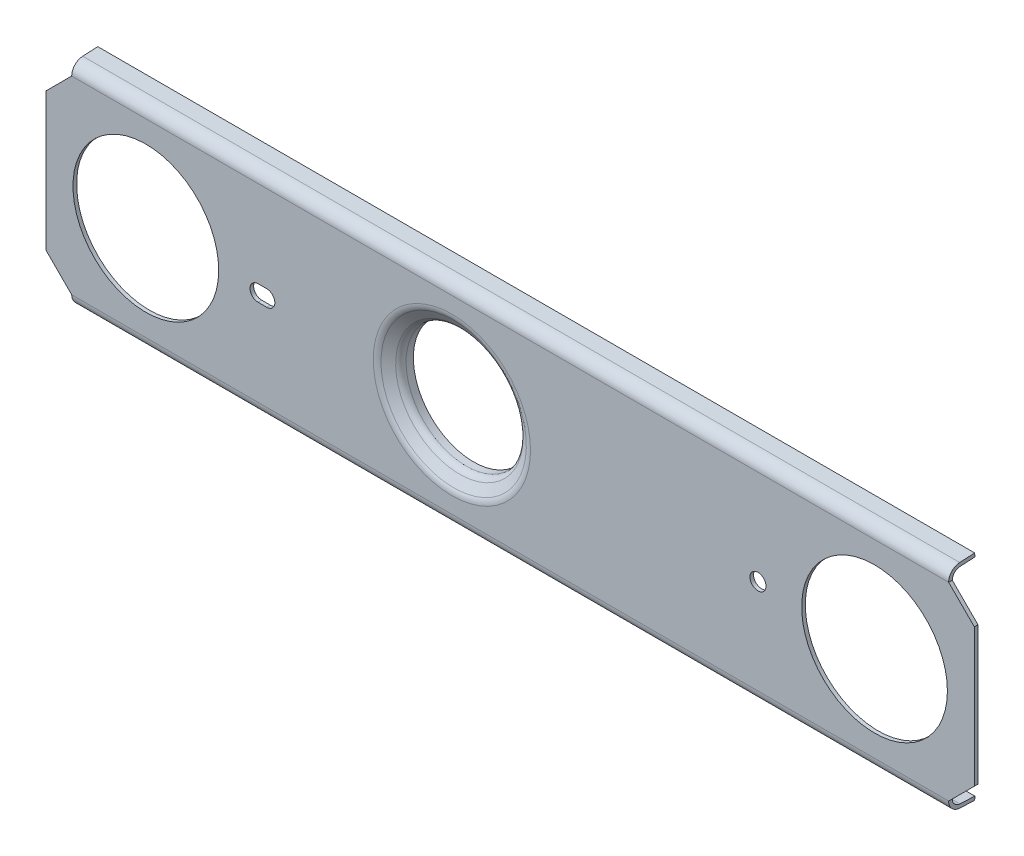
ISO-10303-21;
HEADER;
FILE_DESCRIPTION(('STEP AP214'),'2;1');
FILE_NAME('part.step','',(''),(''),'','','');
FILE_SCHEMA(('AUTOMOTIVE_DESIGN { 1 0 10303 214 1 1 1 1 }'));
ENDSEC;
DATA;
#1=APPLICATION_CONTEXT('core data for automotive mechanical design processes');
#2=APPLICATION_PROTOCOL_DEFINITION('international standard','automotive_design',2000,#1);
#3=PRODUCT_CONTEXT('',#1,'mechanical');
#4=PRODUCT('Part','Part','',(#3));
#5=PRODUCT_RELATED_PRODUCT_CATEGORY('part','',(#4));
#6=PRODUCT_DEFINITION_FORMATION('','',#4);
#7=PRODUCT_DEFINITION_CONTEXT('part definition',#1,'design');
#8=PRODUCT_DEFINITION('design','',#6,#7);
#9=PRODUCT_DEFINITION_SHAPE('','',#8);
#10=(LENGTH_UNIT() NAMED_UNIT(*) SI_UNIT(.MILLI.,.METRE.));
#11=(NAMED_UNIT(*) PLANE_ANGLE_UNIT() SI_UNIT($,.RADIAN.));
#12=(NAMED_UNIT(*) SI_UNIT($,.STERADIAN.) SOLID_ANGLE_UNIT());
#13=UNCERTAINTY_MEASURE_WITH_UNIT(LENGTH_MEASURE(1.E-05),#10,'distance_accuracy_value','');
#14=(GEOMETRIC_REPRESENTATION_CONTEXT(3) GLOBAL_UNCERTAINTY_ASSIGNED_CONTEXT((#13)) GLOBAL_UNIT_ASSIGNED_CONTEXT((#10,
#11,#12)) REPRESENTATION_CONTEXT('',''));
#15=CARTESIAN_POINT('',(0.,0.,0.));
#16=DIRECTION('',(0.,0.,1.));
#17=DIRECTION('',(1.,0.,0.));
#18=AXIS2_PLACEMENT_3D('',#15,#16,#17);
#19=CARTESIAN_POINT('',(-11.5,0.,-4.273055848962));
#20=DIRECTION('',(0.,0.,1.));
#21=DIRECTION('',(1.,0.,0.));
#22=AXIS2_PLACEMENT_3D('',#19,#20,#21);
#23=CYLINDRICAL_SURFACE('',#22,4.375);
#24=CARTESIAN_POINT('',(-11.5,0.,-4.199100808535));
#25=DIRECTION('',(0.,0.,1.));
#26=DIRECTION('',(1.,0.,0.));
#27=AXIS2_PLACEMENT_3D('',#24,#25,#26);
#28=CIRCLE('',#27,4.375);
#29=CARTESIAN_POINT('',(-7.125,0.,-4.199100808535));
#30=VERTEX_POINT('',#29);
#31=EDGE_CURVE('E206',#30,#30,#28,.T.);
#32=ORIENTED_EDGE('',*,*,#31,.T.);
#33=EDGE_LOOP('',(#32));
#34=FACE_BOUND('',#33,.T.);
#35=CARTESIAN_POINT('',(-11.5,0.,-3.699100808535));
#36=DIRECTION('',(0.,0.,1.));
#37=DIRECTION('',(0.,1.,0.));
#38=AXIS2_PLACEMENT_3D('',#35,#36,#37);
#39=CIRCLE('',#38,4.375);
#40=CARTESIAN_POINT('',(-11.5,4.375,-3.699100808535));
#41=VERTEX_POINT('',#40);
#42=EDGE_CURVE('E205',#41,#41,#39,.F.);
#43=ORIENTED_EDGE('',*,*,#42,.T.);
#44=EDGE_LOOP('',(#43));
#45=FACE_BOUND('',#44,.T.);
#46=ADVANCED_FACE('F17',(#34,#45),#23,.T.);
#47=CARTESIAN_POINT('',(-11.5,0.,-4.199100808535));
#48=DIRECTION('',(0.,0.,1.));
#49=DIRECTION('',(1.,0.,0.));
#50=AXIS2_PLACEMENT_3D('',#47,#48,#49);
#51=PLANE('',#50);
#52=CARTESIAN_POINT('',(-11.5,0.,-4.199100808535));
#53=DIRECTION('',(0.,0.,1.));
#54=DIRECTION('',(1.,0.,0.));
#55=AXIS2_PLACEMENT_3D('',#52,#53,#54);
#56=CIRCLE('',#55,4.125);
#57=CARTESIAN_POINT('',(-7.375,0.,-4.199100808535));
#58=VERTEX_POINT('',#57);
#59=EDGE_CURVE('E201',#58,#58,#56,.T.);
#60=ORIENTED_EDGE('',*,*,#59,.T.);
#61=EDGE_LOOP('',(#60));
#62=FACE_BOUND('',#61,.T.);
#63=ORIENTED_EDGE('',*,*,#31,.F.);
#64=EDGE_LOOP('',(#63));
#65=FACE_BOUND('',#64,.T.);
#66=ADVANCED_FACE('F485',(#62,#65),#51,.F.);
#67=CARTESIAN_POINT('',(-11.5,0.,-3.699100808535));
#68=DIRECTION('',(0.,0.,1.));
#69=DIRECTION('',(0.,1.,0.));
#70=AXIS2_PLACEMENT_3D('',#67,#68,#69);
#71=TOROIDAL_SURFACE('',#70,4.675,0.3);
#72=ORIENTED_EDGE('',*,*,#42,.F.);
#73=EDGE_LOOP('',(#72));
#74=FACE_BOUND('',#73,.T.);
#75=CARTESIAN_POINT('',(-11.5,0.,-3.44749963807089));
#76=DIRECTION('',(0.,0.,1.));
#77=DIRECTION('',(0.,1.,0.));
#78=AXIS2_PLACEMENT_3D('',#75,#76,#77);
#79=CIRCLE('',#78,4.5116082894765);
#80=CARTESIAN_POINT('',(-11.5,4.5116082894765,-3.44749963807089));
#81=VERTEX_POINT('',#80);
#82=EDGE_CURVE('E175',#81,#81,#79,.T.);
#83=ORIENTED_EDGE('',*,*,#82,.F.);
#84=EDGE_LOOP('',(#83));
#85=FACE_BOUND('',#84,.T.);
#86=ADVANCED_FACE('F481',(#74,#85),#71,.F.);
#87=CARTESIAN_POINT('',(-11.5,0.,-4.273055848962));
#88=DIRECTION('',(0.,0.,1.));
#89=DIRECTION('',(1.,0.,0.));
#90=AXIS2_PLACEMENT_3D('',#87,#88,#89);
#91=CYLINDRICAL_SURFACE('',#90,4.125);
#92=ORIENTED_EDGE('',*,*,#59,.F.);
#93=EDGE_LOOP('',(#92));
#94=FACE_BOUND('',#93,.T.);
#95=CARTESIAN_POINT('',(-11.5,0.,-3.699100808535));
#96=DIRECTION('',(0.,0.,1.));
#97=DIRECTION('',(0.,1.,0.));
#98=AXIS2_PLACEMENT_3D('',#95,#96,#97);
#99=CIRCLE('',#98,4.125);
#100=CARTESIAN_POINT('',(-11.5,4.125,-3.699100808535));
#101=VERTEX_POINT('',#100);
#102=EDGE_CURVE('E559',#101,#101,#99,.F.);
#103=ORIENTED_EDGE('',*,*,#102,.F.);
#104=EDGE_LOOP('',(#103));
#105=FACE_BOUND('',#104,.T.);
#106=ADVANCED_FACE('F477',(#94,#105),#91,.F.);
#107=CARTESIAN_POINT('',(22.58478643763,7.049246244115,-3.491215224066));
#108=DIRECTION('',(0.,-0.998629534754574,-0.0523359562429386));
#109=DIRECTION('',(0.,0.0523359562429386,-0.998629534754574));
#110=AXIS2_PLACEMENT_3D('',#107,#108,#109);
#111=PLANE('',#110);
#112=DIRECTION('',(1.,0.,0.));
#113=VECTOR('',#112,1.);
#114=CARTESIAN_POINT('',(22.58478643763,7.103162569582,-4.52));
#115=LINE('',#114,#113);
#116=CARTESIAN_POINT('',(22.58478643763,7.10316256958197,-4.52));
#117=VERTEX_POINT('',#116);
#118=CARTESIAN_POINT('',(-37.58678643763,7.10316256958197,-4.52));
#119=VERTEX_POINT('',#118);
#120=EDGE_CURVE('E564',#117,#119,#115,.F.);
#121=ORIENTED_EDGE('',*,*,#120,.F.);
#122=DIRECTION('',(0.,0.0523359562429386,-0.998629534754574));
#123=VECTOR('',#122,1.);
#124=CARTESIAN_POINT('',(22.58478643763,7.049246244115,-3.491215224066));
#125=LINE('',#124,#123);
#126=CARTESIAN_POINT('',(22.58478643763,7.04924624411501,-3.49121522406619));
#127=VERTEX_POINT('',#126);
#128=EDGE_CURVE('E582',#117,#127,#125,.F.);
#129=ORIENTED_EDGE('',*,*,#128,.T.);
#130=DIRECTION('',(1.,0.,0.));
#131=VECTOR('',#130,1.);
#132=CARTESIAN_POINT('',(22.58478643763,7.049246244115,-3.491215224066));
#133=LINE('',#132,#131);
#134=CARTESIAN_POINT('',(-37.58678643763,7.04924624411501,-3.49121522406619));
#135=VERTEX_POINT('',#134);
#136=EDGE_CURVE('E184',#127,#135,#133,.F.);
#137=ORIENTED_EDGE('',*,*,#136,.T.);
#138=DIRECTION('',(0.,0.0523359562429386,-0.998629534754574));
#139=VECTOR('',#138,1.);
#140=CARTESIAN_POINT('',(-37.58678643763,7.049246244115,-3.491215224066));
#141=LINE('',#140,#139);
#142=EDGE_CURVE('E204',#135,#119,#141,.T.);
#143=ORIENTED_EDGE('',*,*,#142,.T.);
#144=EDGE_LOOP('',(#121,#129,#137,#143));
#145=FACE_BOUND('',#144,.T.);
#146=ADVANCED_FACE('F474',(#145),#111,.T.);
#147=CARTESIAN_POINT('',(22.58478643763,-7.103162569582,-4.52));
#148=DIRECTION('',(0.,0.998629534754574,-0.0523359562429386));
#149=DIRECTION('',(0.,0.0523359562429386,0.998629534754574));
#150=AXIS2_PLACEMENT_3D('',#147,#148,#149);
#151=PLANE('',#150);
#152=DIRECTION('',(1.,0.,0.));
#153=VECTOR('',#152,1.);
#154=CARTESIAN_POINT('',(22.58478643763,-7.049246244115,-3.491215224066));
#155=LINE('',#154,#153);
#156=CARTESIAN_POINT('',(-37.58678643763,-7.04924624411506,-3.49121522406619));
#157=VERTEX_POINT('',#156);
#158=CARTESIAN_POINT('',(22.58478643763,-7.04924624411506,-3.49121522406619));
#159=VERTEX_POINT('',#158);
#160=EDGE_CURVE('E179',#157,#159,#155,.T.);
#161=ORIENTED_EDGE('',*,*,#160,.T.);
#162=DIRECTION('',(0.,0.0523359562429386,0.998629534754574));
#163=VECTOR('',#162,1.);
#164=CARTESIAN_POINT('',(22.58478643763,-7.103162569582,-4.52));
#165=LINE('',#164,#163);
#166=CARTESIAN_POINT('',(22.58478643763,-7.10316256958199,-4.51999999999984));
#167=VERTEX_POINT('',#166);
#168=EDGE_CURVE('E164',#159,#167,#165,.F.);
#169=ORIENTED_EDGE('',*,*,#168,.T.);
#170=DIRECTION('',(1.,0.,0.));
#171=VECTOR('',#170,1.);
#172=CARTESIAN_POINT('',(22.58478643763,-7.10316256958199,-4.51999999999976));
#173=LINE('',#172,#171);
#174=CARTESIAN_POINT('',(-37.58678643763,-7.10316256958199,-4.51999999999984));
#175=VERTEX_POINT('',#174);
#176=EDGE_CURVE('E573',#175,#167,#173,.T.);
#177=ORIENTED_EDGE('',*,*,#176,.F.);
#178=DIRECTION('',(0.,0.0523359562429386,0.998629534754574));
#179=VECTOR('',#178,1.);
#180=CARTESIAN_POINT('',(-37.58678643763,-7.103162569582,-4.52));
#181=LINE('',#180,#179);
#182=EDGE_CURVE('E176',#175,#157,#181,.T.);
#183=ORIENTED_EDGE('',*,*,#182,.T.);
#184=EDGE_LOOP('',(#161,#169,#177,#183));
#185=FACE_BOUND('',#184,.T.);
#186=ADVANCED_FACE('F180',(#185),#151,.T.);
#187=CARTESIAN_POINT('',(-11.5,0.,-3.05066471611326));
#188=DIRECTION('',(0.,0.,1.));
#189=DIRECTION('',(1.,0.,0.));
#190=AXIS2_PLACEMENT_3D('',#187,#188,#189);
#191=CONICAL_SURFACE('',#190,5.1226804823159,0.994837673622212);
#192=ORIENTED_EDGE('',*,*,#82,.T.);
#193=EDGE_LOOP('',(#192));
#194=FACE_BOUND('',#193,.T.);
#195=CARTESIAN_POINT('',(-11.5,0.,-3.05066471602742));
#196=DIRECTION('',(0.,0.,1.));
#197=DIRECTION('',(0.,1.,0.));
#198=AXIS2_PLACEMENT_3D('',#195,#196,#197);
#199=CIRCLE('',#198,5.12268048249228);
#200=CARTESIAN_POINT('',(-11.5,5.12268048249228,-3.05066471602742));
#201=VERTEX_POINT('',#200);
#202=EDGE_CURVE('E183',#201,#201,#199,.F.);
#203=ORIENTED_EDGE('',*,*,#202,.T.);
#204=EDGE_LOOP('',(#203));
#205=FACE_BOUND('',#204,.T.);
#206=ADVANCED_FACE('F467',(#194,#205),#191,.T.);
#207=CARTESIAN_POINT('',(22.58478643763,-7.352819953271,-4.506916010939));
#208=DIRECTION('',(0.,-0.0523359562429486,-0.998629534754574));
#209=DIRECTION('',(0.,0.998629534754574,-0.0523359562429486));
#210=AXIS2_PLACEMENT_3D('',#207,#208,#209);
#211=PLANE('',#210);
#212=ORIENTED_EDGE('',*,*,#176,.T.);
#213=DIRECTION('',(0.,0.998629534754574,-0.0523359562429486));
#214=VECTOR('',#213,1.);
#215=CARTESIAN_POINT('',(22.58478643763,-7.352819953271,-4.506916010939));
#216=LINE('',#215,#214);
#217=CARTESIAN_POINT('',(22.58478643763,-7.35281995327095,-4.506916010939));
#218=VERTEX_POINT('',#217);
#219=EDGE_CURVE('E171',#167,#218,#216,.F.);
#220=ORIENTED_EDGE('',*,*,#219,.T.);
#221=DIRECTION('',(1.,0.,0.));
#222=VECTOR('',#221,1.);
#223=CARTESIAN_POINT('',(22.58478643763,-7.35281995327084,-4.50691601093901));
#224=LINE('',#223,#222);
#225=CARTESIAN_POINT('',(-37.58678643763,-7.35281995327095,-4.506916010939));
#226=VERTEX_POINT('',#225);
#227=EDGE_CURVE('E197',#226,#218,#224,.T.);
#228=ORIENTED_EDGE('',*,*,#227,.F.);
#229=DIRECTION('',(0.,0.998629534754574,-0.0523359562429486));
#230=VECTOR('',#229,1.);
#231=CARTESIAN_POINT('',(-37.58678643763,-7.352819953271,-4.506916010939));
#232=LINE('',#231,#230);
#233=EDGE_CURVE('E570',#226,#175,#232,.T.);
#234=ORIENTED_EDGE('',*,*,#233,.T.);
#235=EDGE_LOOP('',(#212,#220,#228,#234));
#236=FACE_BOUND('',#235,.T.);
#237=ADVANCED_FACE('F463',(#236),#211,.T.);
#238=CARTESIAN_POINT('',(22.58478643763,7.103162569582,-4.52));
#239=DIRECTION('',(0.,0.0523359562429386,-0.998629534754574));
#240=DIRECTION('',(0.,0.998629534754574,0.0523359562429386));
#241=AXIS2_PLACEMENT_3D('',#238,#239,#240);
#242=PLANE('',#241);
#243=DIRECTION('',(1.,0.,0.));
#244=VECTOR('',#243,1.);
#245=CARTESIAN_POINT('',(22.58478643763,7.352819953271,-4.506916010939));
#246=LINE('',#245,#244);
#247=CARTESIAN_POINT('',(22.58478643763,7.352819953271,-4.506916010939));
#248=VERTEX_POINT('',#247);
#249=CARTESIAN_POINT('',(-37.58678643763,7.352819953271,-4.50691601093908));
#250=VERTEX_POINT('',#249);
#251=EDGE_CURVE('E378',#248,#250,#246,.F.);
#252=ORIENTED_EDGE('',*,*,#251,.F.);
#253=DIRECTION('',(0.,0.998629534754523,0.0523359562439203));
#254=VECTOR('',#253,1.);
#255=CARTESIAN_POINT('',(22.58478643763,7.103162569582,-4.52));
#256=LINE('',#255,#254);
#257=EDGE_CURVE('E195',#117,#248,#256,.T.);
#258=ORIENTED_EDGE('',*,*,#257,.F.);
#259=ORIENTED_EDGE('',*,*,#120,.T.);
#260=DIRECTION('',(0.,0.998629534754574,0.0523359562429386));
#261=VECTOR('',#260,1.);
#262=CARTESIAN_POINT('',(-37.58678643763,7.103162569582,-4.52));
#263=LINE('',#262,#261);
#264=EDGE_CURVE('E545',#119,#250,#263,.T.);
#265=ORIENTED_EDGE('',*,*,#264,.T.);
#266=EDGE_LOOP('',(#252,#258,#259,#265));
#267=FACE_BOUND('',#266,.T.);
#268=ADVANCED_FACE('F459',(#267),#242,.T.);
#269=CARTESIAN_POINT('',(-11.5,0.,-3.699100808535));
#270=DIRECTION('',(0.,0.,1.));
#271=DIRECTION('',(0.,1.,0.));
#272=AXIS2_PLACEMENT_3D('',#269,#270,#271);
#273=TOROIDAL_SURFACE('',#272,4.675,0.55);
#274=ORIENTED_EDGE('',*,*,#102,.T.);
#275=EDGE_LOOP('',(#274));
#276=FACE_BOUND('',#275,.T.);
#277=CARTESIAN_POINT('',(-11.5,0.,-3.2378319962163));
#278=DIRECTION('',(0.,0.,1.));
#279=DIRECTION('',(0.,1.,0.));
#280=AXIS2_PLACEMENT_3D('',#277,#278,#279);
#281=CIRCLE('',#280,4.37544853070904);
#282=CARTESIAN_POINT('',(-11.5,4.37544853070904,-3.2378319962163));
#283=VERTEX_POINT('',#282);
#284=EDGE_CURVE('E370',#283,#283,#281,.T.);
#285=ORIENTED_EDGE('',*,*,#284,.T.);
#286=EDGE_LOOP('',(#285));
#287=FACE_BOUND('',#286,.T.);
#288=ADVANCED_FACE('F455',(#276,#287),#273,.T.);
#289=CARTESIAN_POINT('',(22.58478643763,6.5,-3.52));
#290=DIRECTION('',(1.,0.,0.));
#291=DIRECTION('',(0.,0.,-1.));
#292=AXIS2_PLACEMENT_3D('',#289,#290,#291);
#293=CYLINDRICAL_SURFACE('',#292,0.55);
#294=ORIENTED_EDGE('',*,*,#136,.F.);
#295=CARTESIAN_POINT('',(22.58478643763,6.5,-3.52));
#296=DIRECTION('',(1.,0.,0.));
#297=DIRECTION('',(0.,0.,-1.));
#298=AXIS2_PLACEMENT_3D('',#295,#296,#297);
#299=CIRCLE('',#298,0.55);
#300=CARTESIAN_POINT('',(22.5847864376285,6.49999999999925,-2.97));
#301=VERTEX_POINT('',#300);
#302=EDGE_CURVE('E191',#301,#127,#299,.F.);
#303=ORIENTED_EDGE('',*,*,#302,.F.);
#304=DIRECTION('',(1.,0.,0.));
#305=VECTOR('',#304,1.);
#306=CARTESIAN_POINT('',(0.,6.5,-2.97));
#307=LINE('',#306,#305);
#308=CARTESIAN_POINT('',(-37.58678643763,6.5,-2.97));
#309=VERTEX_POINT('',#308);
#310=EDGE_CURVE('E330',#301,#309,#307,.F.);
#311=ORIENTED_EDGE('',*,*,#310,.T.);
#312=CARTESIAN_POINT('',(-37.58678643763,6.5,-3.52));
#313=DIRECTION('',(1.,0.,0.));
#314=DIRECTION('',(0.,0.,-1.));
#315=AXIS2_PLACEMENT_3D('',#312,#313,#314);
#316=CIRCLE('',#315,0.55);
#317=EDGE_CURVE('E361',#309,#135,#316,.F.);
#318=ORIENTED_EDGE('',*,*,#317,.T.);
#319=EDGE_LOOP('',(#294,#303,#311,#318));
#320=FACE_BOUND('',#319,.T.);
#321=ADVANCED_FACE('F458',(#320),#293,.F.);
#322=CARTESIAN_POINT('',(22.58478643763,-6.5,-3.52));
#323=DIRECTION('',(1.,0.,0.));
#324=DIRECTION('',(0.,0.,-1.));
#325=AXIS2_PLACEMENT_3D('',#322,#323,#324);
#326=CYLINDRICAL_SURFACE('',#325,0.55);
#327=ORIENTED_EDGE('',*,*,#160,.F.);
#328=CARTESIAN_POINT('',(-37.58678643763,-6.5,-3.52));
#329=DIRECTION('',(1.,0.,0.));
#330=DIRECTION('',(0.,0.,-1.));
#331=AXIS2_PLACEMENT_3D('',#328,#329,#330);
#332=CIRCLE('',#331,0.55);
#333=CARTESIAN_POINT('',(-37.5867864376285,-6.49999999999925,-2.97));
#334=VERTEX_POINT('',#333);
#335=EDGE_CURVE('E304',#157,#334,#332,.F.);
#336=ORIENTED_EDGE('',*,*,#335,.T.);
#337=DIRECTION('',(1.,0.,0.));
#338=VECTOR('',#337,1.);
#339=CARTESIAN_POINT('',(0.,-6.5,-2.97));
#340=LINE('',#339,#338);
#341=CARTESIAN_POINT('',(22.58478643763,-6.5,-2.97));
#342=VERTEX_POINT('',#341);
#343=EDGE_CURVE('E189',#334,#342,#340,.T.);
#344=ORIENTED_EDGE('',*,*,#343,.T.);
#345=CARTESIAN_POINT('',(22.58478643763,-6.5,-3.52));
#346=DIRECTION('',(1.,0.,0.));
#347=DIRECTION('',(0.,0.,-1.));
#348=AXIS2_PLACEMENT_3D('',#345,#346,#347);
#349=CIRCLE('',#348,0.55);
#350=EDGE_CURVE('E168',#159,#342,#349,.F.);
#351=ORIENTED_EDGE('',*,*,#350,.F.);
#352=EDGE_LOOP('',(#327,#336,#344,#351));
#353=FACE_BOUND('',#352,.T.);
#354=ADVANCED_FACE('F187',(#353),#326,.F.);
#355=CARTESIAN_POINT('',(-11.5,0.,-3.47));
#356=DIRECTION('',(0.,0.,1.));
#357=DIRECTION('',(0.,1.,0.));
#358=AXIS2_PLACEMENT_3D('',#355,#356,#357);
#359=TOROIDAL_SURFACE('',#358,5.395,0.5);
#360=ORIENTED_EDGE('',*,*,#202,.F.);
#361=EDGE_LOOP('',(#360));
#362=FACE_BOUND('',#361,.T.);
#363=CARTESIAN_POINT('',(-11.5,0.,-2.97));
#364=DIRECTION('',(0.,0.,-1.));
#365=DIRECTION('',(0.,-1.,0.));
#366=AXIS2_PLACEMENT_3D('',#363,#364,#365);
#367=CIRCLE('',#366,5.395);
#368=CARTESIAN_POINT('',(-11.5,-5.395,-2.97));
#369=VERTEX_POINT('',#368);
#370=CARTESIAN_POINT('',(-11.5,5.395,-2.97));
#371=VERTEX_POINT('',#370);
#372=EDGE_CURVE('E263',#369,#371,#367,.T.);
#373=ORIENTED_EDGE('',*,*,#372,.T.);
#374=CARTESIAN_POINT('',(-11.5,0.,-2.97));
#375=DIRECTION('',(0.,0.,-1.));
#376=DIRECTION('',(0.,1.,0.));
#377=AXIS2_PLACEMENT_3D('',#374,#375,#376);
#378=CIRCLE('',#377,5.395);
#379=EDGE_CURVE('E520',#371,#369,#378,.T.);
#380=ORIENTED_EDGE('',*,*,#379,.T.);
#381=EDGE_LOOP('',(#373,#380));
#382=FACE_BOUND('',#381,.T.);
#383=ADVANCED_FACE('F432',(#362,#382),#359,.F.);
#384=CARTESIAN_POINT('',(22.58478643763,-7.298903627804,-3.478131235006));
#385=DIRECTION('',(0.,-0.998629534754574,0.0523359562429386));
#386=DIRECTION('',(0.,-0.0523359562429386,-0.998629534754574));
#387=AXIS2_PLACEMENT_3D('',#384,#385,#386);
#388=PLANE('',#387);
#389=ORIENTED_EDGE('',*,*,#227,.T.);
#390=DIRECTION('',(0.,-0.0523359562431907,-0.998629534754561));
#391=VECTOR('',#390,1.);
#392=CARTESIAN_POINT('',(22.58478643763,-7.298903627804,-3.478131235008));
#393=LINE('',#392,#391);
#394=CARTESIAN_POINT('',(22.58478643763,-7.29890362780383,-3.47813123500672));
#395=VERTEX_POINT('',#394);
#396=EDGE_CURVE('E192',#395,#218,#393,.T.);
#397=ORIENTED_EDGE('',*,*,#396,.F.);
#398=DIRECTION('',(1.,0.,0.));
#399=VECTOR('',#398,1.);
#400=CARTESIAN_POINT('',(22.58478643763,-7.29890362780378,-3.47813123500801));
#401=LINE('',#400,#399);
#402=CARTESIAN_POINT('',(-37.58678643763,-7.29890362780383,-3.47813123500672));
#403=VERTEX_POINT('',#402);
#404=EDGE_CURVE('E425',#403,#395,#401,.T.);
#405=ORIENTED_EDGE('',*,*,#404,.F.);
#406=DIRECTION('',(0.,-0.0523359562431907,-0.998629534754561));
#407=VECTOR('',#406,1.);
#408=CARTESIAN_POINT('',(-37.58678643763,-7.298903627804,-3.478131235008));
#409=LINE('',#408,#407);
#410=EDGE_CURVE('E301',#403,#226,#409,.T.);
#411=ORIENTED_EDGE('',*,*,#410,.T.);
#412=EDGE_LOOP('',(#389,#397,#405,#411));
#413=FACE_BOUND('',#412,.T.);
#414=ADVANCED_FACE('F437',(#413),#388,.T.);
#415=CARTESIAN_POINT('',(22.58478643763,0.,0.));
#416=DIRECTION('',(1.,0.,0.));
#417=DIRECTION('',(0.,0.,-1.));
#418=AXIS2_PLACEMENT_3D('',#415,#416,#417);
#419=PLANE('',#418);
#420=ORIENTED_EDGE('',*,*,#350,.T.);
#421=DIRECTION('',(0.,0.,1.));
#422=VECTOR('',#421,1.);
#423=CARTESIAN_POINT('',(22.58478643763,-6.5,-2.97));
#424=LINE('',#423,#422);
#425=CARTESIAN_POINT('',(22.58478643763,-6.5,-2.72));
#426=VERTEX_POINT('',#425);
#427=EDGE_CURVE('E410',#426,#342,#424,.F.);
#428=ORIENTED_EDGE('',*,*,#427,.F.);
#429=CARTESIAN_POINT('',(22.58478643763,-6.5,-3.52));
#430=DIRECTION('',(1.,0.,0.));
#431=DIRECTION('',(0.,0.,-1.));
#432=AXIS2_PLACEMENT_3D('',#429,#430,#431);
#433=CIRCLE('',#432,0.8);
#434=EDGE_CURVE('E415',#395,#426,#433,.F.);
#435=ORIENTED_EDGE('',*,*,#434,.F.);
#436=ORIENTED_EDGE('',*,*,#396,.T.);
#437=ORIENTED_EDGE('',*,*,#219,.F.);
#438=ORIENTED_EDGE('',*,*,#168,.F.);
#439=EDGE_LOOP('',(#420,#428,#435,#436,#437,#438));
#440=FACE_BOUND('',#439,.T.);
#441=ADVANCED_FACE('F166',(#440),#419,.T.);
#442=CARTESIAN_POINT('',(22.58478643763,0.,0.));
#443=DIRECTION('',(1.,0.,0.));
#444=DIRECTION('',(0.,0.,-1.));
#445=AXIS2_PLACEMENT_3D('',#442,#443,#444);
#446=PLANE('',#445);
#447=CARTESIAN_POINT('',(22.58478643763,6.5,-3.52));
#448=DIRECTION('',(1.,0.,0.));
#449=DIRECTION('',(0.,0.,-1.));
#450=AXIS2_PLACEMENT_3D('',#447,#448,#449);
#451=CIRCLE('',#450,0.8);
#452=CARTESIAN_POINT('',(22.5847864376292,6.49999999999887,-2.72));
#453=VERTEX_POINT('',#452);
#454=CARTESIAN_POINT('',(22.58478643763,7.29890362780399,-3.47813123500732));
#455=VERTEX_POINT('',#454);
#456=EDGE_CURVE('E374',#453,#455,#451,.F.);
#457=ORIENTED_EDGE('',*,*,#456,.F.);
#458=DIRECTION('',(0.,0.,1.));
#459=VECTOR('',#458,1.);
#460=CARTESIAN_POINT('',(22.5847864376285,6.4999999999985,-2.97));
#461=LINE('',#460,#459);
#462=EDGE_CURVE('E381',#301,#453,#461,.T.);
#463=ORIENTED_EDGE('',*,*,#462,.F.);
#464=ORIENTED_EDGE('',*,*,#302,.T.);
#465=ORIENTED_EDGE('',*,*,#128,.F.);
#466=ORIENTED_EDGE('',*,*,#257,.T.);
#467=DIRECTION('',(0.,-0.0523359562429386,0.998629534754574));
#468=VECTOR('',#467,1.);
#469=CARTESIAN_POINT('',(22.58478643763,7.352819953271,-4.506916010939));
#470=LINE('',#469,#468);
#471=EDGE_CURVE('E375',#455,#248,#470,.F.);
#472=ORIENTED_EDGE('',*,*,#471,.F.);
#473=EDGE_LOOP('',(#457,#463,#464,#465,#466,#472));
#474=FACE_BOUND('',#473,.T.);
#475=ADVANCED_FACE('F619',(#474),#446,.T.);
#476=CARTESIAN_POINT('',(22.58478643763,7.352819953271,-4.506916010939));
#477=DIRECTION('',(0.,0.998629534754574,0.0523359562429386));
#478=DIRECTION('',(0.,-0.0523359562429386,0.998629534754574));
#479=AXIS2_PLACEMENT_3D('',#476,#477,#478);
#480=PLANE('',#479);
#481=DIRECTION('',(1.,0.,0.));
#482=VECTOR('',#481,1.);
#483=CARTESIAN_POINT('',(22.58478643763,7.29890362780384,-3.47813123500901));
#484=LINE('',#483,#482);
#485=CARTESIAN_POINT('',(-37.58678643763,7.29890362780382,-3.4781312350072));
#486=VERTEX_POINT('',#485);
#487=EDGE_CURVE('E371',#455,#486,#484,.F.);
#488=ORIENTED_EDGE('',*,*,#487,.F.);
#489=ORIENTED_EDGE('',*,*,#471,.T.);
#490=ORIENTED_EDGE('',*,*,#251,.T.);
#491=DIRECTION('',(0.,-0.0523359562432415,0.998629534754558));
#492=VECTOR('',#491,1.);
#493=CARTESIAN_POINT('',(-37.58678643763,7.352819953271,-4.506916010939));
#494=LINE('',#493,#492);
#495=EDGE_CURVE('E305',#250,#486,#494,.T.);
#496=ORIENTED_EDGE('',*,*,#495,.T.);
#497=EDGE_LOOP('',(#488,#489,#490,#496));
#498=FACE_BOUND('',#497,.T.);
#499=ADVANCED_FACE('F549',(#498),#480,.T.);
#500=CARTESIAN_POINT('',(-37.58678643763,0.,0.));
#501=DIRECTION('',(1.,0.,0.));
#502=DIRECTION('',(0.,0.,-1.));
#503=AXIS2_PLACEMENT_3D('',#500,#501,#502);
#504=PLANE('',#503);
#505=ORIENTED_EDGE('',*,*,#495,.F.);
#506=ORIENTED_EDGE('',*,*,#264,.F.);
#507=ORIENTED_EDGE('',*,*,#142,.F.);
#508=ORIENTED_EDGE('',*,*,#317,.F.);
#509=DIRECTION('',(0.,0.,1.));
#510=VECTOR('',#509,1.);
#511=CARTESIAN_POINT('',(-37.58678643763,6.5,-2.97));
#512=LINE('',#511,#510);
#513=CARTESIAN_POINT('',(-37.58678643763,6.5,-2.72));
#514=VERTEX_POINT('',#513);
#515=EDGE_CURVE('E347',#514,#309,#512,.F.);
#516=ORIENTED_EDGE('',*,*,#515,.F.);
#517=CARTESIAN_POINT('',(-37.58678643763,6.5,-3.52));
#518=DIRECTION('',(1.,0.,0.));
#519=DIRECTION('',(0.,0.,-1.));
#520=AXIS2_PLACEMENT_3D('',#517,#518,#519);
#521=CIRCLE('',#520,0.8);
#522=EDGE_CURVE('E352',#486,#514,#521,.T.);
#523=ORIENTED_EDGE('',*,*,#522,.F.);
#524=EDGE_LOOP('',(#505,#506,#507,#508,#516,#523));
#525=FACE_BOUND('',#524,.T.);
#526=ADVANCED_FACE('F530',(#525),#504,.F.);
#527=CARTESIAN_POINT('',(-37.58678643763,0.,0.));
#528=DIRECTION('',(1.,0.,0.));
#529=DIRECTION('',(0.,0.,-1.));
#530=AXIS2_PLACEMENT_3D('',#527,#528,#529);
#531=PLANE('',#530);
#532=ORIENTED_EDGE('',*,*,#182,.F.);
#533=ORIENTED_EDGE('',*,*,#233,.F.);
#534=ORIENTED_EDGE('',*,*,#410,.F.);
#535=CARTESIAN_POINT('',(-37.58678643763,-6.5,-3.52));
#536=DIRECTION('',(1.,0.,0.));
#537=DIRECTION('',(0.,0.,-1.));
#538=AXIS2_PLACEMENT_3D('',#535,#536,#537);
#539=CIRCLE('',#538,0.8);
#540=CARTESIAN_POINT('',(-37.5867864376293,-6.49999999999887,-2.72));
#541=VERTEX_POINT('',#540);
#542=EDGE_CURVE('E428',#541,#403,#539,.T.);
#543=ORIENTED_EDGE('',*,*,#542,.F.);
#544=DIRECTION('',(0.,0.,1.));
#545=VECTOR('',#544,1.);
#546=CARTESIAN_POINT('',(-37.5867864376285,-6.4999999999985,-2.97));
#547=LINE('',#546,#545);
#548=EDGE_CURVE('E311',#334,#541,#547,.T.);
#549=ORIENTED_EDGE('',*,*,#548,.F.);
#550=ORIENTED_EDGE('',*,*,#335,.F.);
#551=EDGE_LOOP('',(#532,#533,#534,#543,#549,#550));
#552=FACE_BOUND('',#551,.T.);
#553=ADVANCED_FACE('F599',(#552),#531,.F.);
#554=CARTESIAN_POINT('',(-11.5,0.,-2.84099707408814));
#555=DIRECTION('',(0.,0.,1.));
#556=DIRECTION('',(1.,0.,0.));
#557=AXIS2_PLACEMENT_3D('',#554,#555,#556);
#558=CONICAL_SURFACE('',#557,4.98652072371897,0.994837673618825);
#559=ORIENTED_EDGE('',*,*,#284,.F.);
#560=EDGE_LOOP('',(#559));
#561=FACE_BOUND('',#560,.T.);
#562=CARTESIAN_POINT('',(-11.5,0.,-2.84099707404083));
#563=DIRECTION('',(0.,0.,1.));
#564=DIRECTION('',(0.,1.,0.));
#565=AXIS2_PLACEMENT_3D('',#562,#563,#564);
#566=CIRCLE('',#565,4.98652072373889);
#567=CARTESIAN_POINT('',(-11.5,4.98652072373889,-2.84099707404083));
#568=VERTEX_POINT('',#567);
#569=EDGE_CURVE('E247',#568,#568,#566,.F.);
#570=ORIENTED_EDGE('',*,*,#569,.F.);
#571=EDGE_LOOP('',(#570));
#572=FACE_BOUND('',#571,.T.);
#573=ADVANCED_FACE('F280',(#561,#572),#558,.F.);
#574=CARTESIAN_POINT('',(0.,0.,-2.97));
#575=DIRECTION('',(0.,0.,1.));
#576=DIRECTION('',(1.,0.,0.));
#577=AXIS2_PLACEMENT_3D('',#574,#575,#576);
#578=PLANE('',#577);
#579=CARTESIAN_POINT('',(17.5,0.,-2.97));
#580=DIRECTION('',(0.,0.,1.));
#581=DIRECTION('',(1.,0.,0.));
#582=AXIS2_PLACEMENT_3D('',#579,#580,#581);
#583=CIRCLE('',#582,5.);
#584=CARTESIAN_POINT('',(22.5,0.,-2.97));
#585=VERTEX_POINT('',#584);
#586=EDGE_CURVE('E295',#585,#585,#583,.T.);
#587=ORIENTED_EDGE('',*,*,#586,.T.);
#588=EDGE_LOOP('',(#587));
#589=FACE_BOUND('',#588,.T.);
#590=ORIENTED_EDGE('',*,*,#372,.F.);
#591=ORIENTED_EDGE('',*,*,#379,.F.);
#592=EDGE_LOOP('',(#590,#591));
#593=FACE_BOUND('',#592,.T.);
#594=CARTESIAN_POINT('',(-24.2,0.,-2.97));
#595=DIRECTION('',(0.,0.,1.));
#596=DIRECTION('',(1.,0.,0.));
#597=AXIS2_PLACEMENT_3D('',#594,#595,#596);
#598=CIRCLE('',#597,0.55);
#599=CARTESIAN_POINT('',(-24.2,-0.55,-2.97));
#600=VERTEX_POINT('',#599);
#601=CARTESIAN_POINT('',(-24.2,0.55,-2.97));
#602=VERTEX_POINT('',#601);
#603=EDGE_CURVE('E254',#600,#602,#598,.T.);
#604=ORIENTED_EDGE('',*,*,#603,.T.);
#605=DIRECTION('',(1.,0.,0.));
#606=VECTOR('',#605,1.);
#607=CARTESIAN_POINT('',(-24.2,0.55,-2.97));
#608=LINE('',#607,#606);
#609=CARTESIAN_POINT('',(-24.8,0.55,-2.97));
#610=VERTEX_POINT('',#609);
#611=EDGE_CURVE('E258',#602,#610,#608,.F.);
#612=ORIENTED_EDGE('',*,*,#611,.T.);
#613=CARTESIAN_POINT('',(-24.8,0.,-2.97));
#614=DIRECTION('',(0.,0.,1.));
#615=DIRECTION('',(1.,0.,0.));
#616=AXIS2_PLACEMENT_3D('',#613,#614,#615);
#617=CIRCLE('',#616,0.55);
#618=CARTESIAN_POINT('',(-24.8,-0.55,-2.97));
#619=VERTEX_POINT('',#618);
#620=EDGE_CURVE('E300',#610,#619,#617,.T.);
#621=ORIENTED_EDGE('',*,*,#620,.T.);
#622=DIRECTION('',(1.,0.,0.));
#623=VECTOR('',#622,1.);
#624=CARTESIAN_POINT('',(-24.8,-0.55,-2.97));
#625=LINE('',#624,#623);
#626=EDGE_CURVE('E248',#619,#600,#625,.T.);
#627=ORIENTED_EDGE('',*,*,#626,.T.);
#628=EDGE_LOOP('',(#604,#612,#621,#627));
#629=FACE_BOUND('',#628,.T.);
#630=CARTESIAN_POINT('',(9.5,0.,-2.97));
#631=DIRECTION('',(0.,0.,1.));
#632=DIRECTION('',(1.,0.,0.));
#633=AXIS2_PLACEMENT_3D('',#630,#631,#632);
#634=CIRCLE('',#633,0.55);
#635=CARTESIAN_POINT('',(10.05,0.,-2.97));
#636=VERTEX_POINT('',#635);
#637=EDGE_CURVE('E507',#636,#636,#634,.T.);
#638=ORIENTED_EDGE('',*,*,#637,.T.);
#639=EDGE_LOOP('',(#638));
#640=FACE_BOUND('',#639,.T.);
#641=CARTESIAN_POINT('',(-32.5,0.,-2.97));
#642=DIRECTION('',(0.,0.,1.));
#643=DIRECTION('',(1.,0.,0.));
#644=AXIS2_PLACEMENT_3D('',#641,#642,#643);
#645=CIRCLE('',#644,5.);
#646=CARTESIAN_POINT('',(-27.5,0.,-2.97));
#647=VERTEX_POINT('',#646);
#648=EDGE_CURVE('E317',#647,#647,#645,.T.);
#649=ORIENTED_EDGE('',*,*,#648,.T.);
#650=EDGE_LOOP('',(#649));
#651=FACE_BOUND('',#650,.T.);
#652=DIRECTION('',(0.707106781186548,-0.707106781186548,0.));
#653=VECTOR('',#652,1.);
#654=CARTESIAN_POINT('',(-39.351,-4.735786437627,-2.97));
#655=LINE('',#654,#653);
#656=CARTESIAN_POINT('',(-39.351,-4.735786437627,-2.97));
#657=VERTEX_POINT('',#656);
#658=EDGE_CURVE('E308',#657,#334,#655,.T.);
#659=ORIENTED_EDGE('',*,*,#658,.F.);
#660=DIRECTION('',(0.,1.,0.));
#661=VECTOR('',#660,1.);
#662=CARTESIAN_POINT('',(-39.351,4.735786437627,-2.97));
#663=LINE('',#662,#661);
#664=CARTESIAN_POINT('',(-39.3510000000002,4.73578643762917,-2.97));
#665=VERTEX_POINT('',#664);
#666=EDGE_CURVE('E333',#665,#657,#663,.F.);
#667=ORIENTED_EDGE('',*,*,#666,.F.);
#668=DIRECTION('',(-0.707106781186548,-0.707106781186548,0.));
#669=VECTOR('',#668,1.);
#670=CARTESIAN_POINT('',(-37.58678643763,6.5,-2.97));
#671=LINE('',#670,#669);
#672=EDGE_CURVE('E350',#309,#665,#671,.T.);
#673=ORIENTED_EDGE('',*,*,#672,.F.);
#674=ORIENTED_EDGE('',*,*,#310,.F.);
#675=DIRECTION('',(-0.707106781186548,0.707106781186548,0.));
#676=VECTOR('',#675,1.);
#677=CARTESIAN_POINT('',(24.349,4.735786437627,-2.97));
#678=LINE('',#677,#676);
#679=CARTESIAN_POINT('',(24.349,4.735786437627,-2.97));
#680=VERTEX_POINT('',#679);
#681=EDGE_CURVE('E384',#680,#301,#678,.T.);
#682=ORIENTED_EDGE('',*,*,#681,.F.);
#683=DIRECTION('',(0.,1.,0.));
#684=VECTOR('',#683,1.);
#685=CARTESIAN_POINT('',(24.349,-4.735786437627,-2.97));
#686=LINE('',#685,#684);
#687=CARTESIAN_POINT('',(24.3490000000003,-4.73578643762833,-2.97));
#688=VERTEX_POINT('',#687);
#689=EDGE_CURVE('E397',#688,#680,#686,.T.);
#690=ORIENTED_EDGE('',*,*,#689,.F.);
#691=DIRECTION('',(0.707106781186548,0.707106781186548,0.));
#692=VECTOR('',#691,1.);
#693=CARTESIAN_POINT('',(22.58478643763,-6.5,-2.97));
#694=LINE('',#693,#692);
#695=EDGE_CURVE('E413',#342,#688,#694,.T.);
#696=ORIENTED_EDGE('',*,*,#695,.F.);
#697=ORIENTED_EDGE('',*,*,#343,.F.);
#698=EDGE_LOOP('',(#659,#667,#673,#674,#682,#690,#696,#697));
#699=FACE_BOUND('',#698,.T.);
#700=ADVANCED_FACE('F269',(#589,#593,#629,#640,#651,#699),#578,.F.);
#701=CARTESIAN_POINT('',(22.58478643763,-6.5,-3.52));
#702=DIRECTION('',(1.,0.,0.));
#703=DIRECTION('',(0.,0.,-1.));
#704=AXIS2_PLACEMENT_3D('',#701,#702,#703);
#705=CYLINDRICAL_SURFACE('',#704,0.8);
#706=ORIENTED_EDGE('',*,*,#434,.T.);
#707=DIRECTION('',(1.,0.,0.));
#708=VECTOR('',#707,1.);
#709=CARTESIAN_POINT('',(0.,-6.5,-2.72));
#710=LINE('',#709,#708);
#711=EDGE_CURVE('E318',#541,#426,#710,.T.);
#712=ORIENTED_EDGE('',*,*,#711,.F.);
#713=ORIENTED_EDGE('',*,*,#542,.T.);
#714=ORIENTED_EDGE('',*,*,#404,.T.);
#715=EDGE_LOOP('',(#706,#712,#713,#714));
#716=FACE_BOUND('',#715,.T.);
#717=ADVANCED_FACE('F279',(#716),#705,.T.);
#718=CARTESIAN_POINT('',(22.58478643763,-6.5,-2.97));
#719=DIRECTION('',(0.707106781186548,-0.707106781186548,0.));
#720=DIRECTION('',(0.707106781186548,0.707106781186548,0.));
#721=AXIS2_PLACEMENT_3D('',#718,#719,#720);
#722=PLANE('',#721);
#723=DIRECTION('',(0.707106781186146,0.707106781186949,0.));
#724=VECTOR('',#723,1.);
#725=CARTESIAN_POINT('',(22.58478643763,-6.5,-2.72));
#726=LINE('',#725,#724);
#727=CARTESIAN_POINT('',(24.349,-4.73578643762825,-2.72));
#728=VERTEX_POINT('',#727);
#729=EDGE_CURVE('E321',#426,#728,#726,.T.);
#730=ORIENTED_EDGE('',*,*,#729,.F.);
#731=ORIENTED_EDGE('',*,*,#427,.T.);
#732=ORIENTED_EDGE('',*,*,#695,.T.);
#733=DIRECTION('',(0.,0.,-1.));
#734=VECTOR('',#733,1.);
#735=CARTESIAN_POINT('',(24.349,-4.735786437628,-2.97));
#736=LINE('',#735,#734);
#737=EDGE_CURVE('E401',#728,#688,#736,.T.);
#738=ORIENTED_EDGE('',*,*,#737,.F.);
#739=EDGE_LOOP('',(#730,#731,#732,#738));
#740=FACE_BOUND('',#739,.T.);
#741=ADVANCED_FACE('F608',(#740),#722,.T.);
#742=CARTESIAN_POINT('',(24.349,-4.735786437627,-2.97));
#743=DIRECTION('',(1.,0.,0.));
#744=DIRECTION('',(0.,0.,-1.));
#745=AXIS2_PLACEMENT_3D('',#742,#743,#744);
#746=PLANE('',#745);
#747=ORIENTED_EDGE('',*,*,#737,.T.);
#748=ORIENTED_EDGE('',*,*,#689,.T.);
#749=DIRECTION('',(0.,0.,1.));
#750=VECTOR('',#749,1.);
#751=CARTESIAN_POINT('',(24.349,4.735786437627,-2.97));
#752=LINE('',#751,#750);
#753=CARTESIAN_POINT('',(24.349,4.735786437627,-2.72));
#754=VERTEX_POINT('',#753);
#755=EDGE_CURVE('E392',#754,#680,#752,.F.);
#756=ORIENTED_EDGE('',*,*,#755,.F.);
#757=DIRECTION('',(0.,1.,0.));
#758=VECTOR('',#757,1.);
#759=CARTESIAN_POINT('',(24.349,0.,-2.72));
#760=LINE('',#759,#758);
#761=EDGE_CURVE('E387',#728,#754,#760,.T.);
#762=ORIENTED_EDGE('',*,*,#761,.F.);
#763=EDGE_LOOP('',(#747,#748,#756,#762));
#764=FACE_BOUND('',#763,.T.);
#765=ADVANCED_FACE('F696',(#764),#746,.T.);
#766=CARTESIAN_POINT('',(24.349,4.735786437627,-2.97));
#767=DIRECTION('',(0.707106781186548,0.707106781186548,0.));
#768=DIRECTION('',(-0.707106781186548,0.707106781186548,0.));
#769=AXIS2_PLACEMENT_3D('',#766,#767,#768);
#770=PLANE('',#769);
#771=ORIENTED_EDGE('',*,*,#681,.T.);
#772=ORIENTED_EDGE('',*,*,#462,.T.);
#773=DIRECTION('',(-0.707106781185946,0.707106781187149,0.));
#774=VECTOR('',#773,1.);
#775=CARTESIAN_POINT('',(24.349,4.735786437627,-2.72));
#776=LINE('',#775,#774);
#777=EDGE_CURVE('E368',#754,#453,#776,.T.);
#778=ORIENTED_EDGE('',*,*,#777,.F.);
#779=ORIENTED_EDGE('',*,*,#755,.T.);
#780=EDGE_LOOP('',(#771,#772,#778,#779));
#781=FACE_BOUND('',#780,.T.);
#782=ADVANCED_FACE('F693',(#781),#770,.T.);
#783=CARTESIAN_POINT('',(22.58478643763,6.5,-3.52));
#784=DIRECTION('',(1.,0.,0.));
#785=DIRECTION('',(0.,0.,-1.));
#786=AXIS2_PLACEMENT_3D('',#783,#784,#785);
#787=CYLINDRICAL_SURFACE('',#786,0.8);
#788=ORIENTED_EDGE('',*,*,#522,.T.);
#789=DIRECTION('',(1.,0.,0.));
#790=VECTOR('',#789,1.);
#791=CARTESIAN_POINT('',(0.,6.5,-2.72));
#792=LINE('',#791,#790);
#793=EDGE_CURVE('E357',#453,#514,#792,.F.);
#794=ORIENTED_EDGE('',*,*,#793,.F.);
#795=ORIENTED_EDGE('',*,*,#456,.T.);
#796=ORIENTED_EDGE('',*,*,#487,.T.);
#797=EDGE_LOOP('',(#788,#794,#795,#796));
#798=FACE_BOUND('',#797,.T.);
#799=ADVANCED_FACE('F543',(#798),#787,.T.);
#800=CARTESIAN_POINT('',(-37.58678643763,6.5,-2.97));
#801=DIRECTION('',(-0.707106781186548,0.707106781186548,0.));
#802=DIRECTION('',(-0.707106781186548,-0.707106781186548,0.));
#803=AXIS2_PLACEMENT_3D('',#800,#801,#802);
#804=PLANE('',#803);
#805=DIRECTION('',(-0.707106781186345,-0.70710678118675,0.));
#806=VECTOR('',#805,1.);
#807=CARTESIAN_POINT('',(-37.58678643763,6.5,-2.72));
#808=LINE('',#807,#806);
#809=CARTESIAN_POINT('',(-39.351,4.73578643762912,-2.72));
#810=VERTEX_POINT('',#809);
#811=EDGE_CURVE('E342',#514,#810,#808,.T.);
#812=ORIENTED_EDGE('',*,*,#811,.F.);
#813=ORIENTED_EDGE('',*,*,#515,.T.);
#814=ORIENTED_EDGE('',*,*,#672,.T.);
#815=DIRECTION('',(0.,0.,1.));
#816=VECTOR('',#815,1.);
#817=CARTESIAN_POINT('',(-39.351,4.735786437629,-2.97));
#818=LINE('',#817,#816);
#819=EDGE_CURVE('E337',#810,#665,#818,.F.);
#820=ORIENTED_EDGE('',*,*,#819,.F.);
#821=EDGE_LOOP('',(#812,#813,#814,#820));
#822=FACE_BOUND('',#821,.T.);
#823=ADVANCED_FACE('F535',(#822),#804,.T.);
#824=CARTESIAN_POINT('',(-39.351,4.735786437627,-2.97));
#825=DIRECTION('',(-1.,0.,0.));
#826=DIRECTION('',(0.,0.,1.));
#827=AXIS2_PLACEMENT_3D('',#824,#825,#826);
#828=PLANE('',#827);
#829=ORIENTED_EDGE('',*,*,#819,.T.);
#830=ORIENTED_EDGE('',*,*,#666,.T.);
#831=DIRECTION('',(0.,0.,1.));
#832=VECTOR('',#831,1.);
#833=CARTESIAN_POINT('',(-39.351,-4.735786437627,-2.97));
#834=LINE('',#833,#832);
#835=CARTESIAN_POINT('',(-39.351,-4.735786437627,-2.72));
#836=VERTEX_POINT('',#835);
#837=EDGE_CURVE('E312',#836,#657,#834,.F.);
#838=ORIENTED_EDGE('',*,*,#837,.F.);
#839=DIRECTION('',(0.,1.,0.));
#840=VECTOR('',#839,1.);
#841=CARTESIAN_POINT('',(-39.351,0.,-2.72));
#842=LINE('',#841,#840);
#843=EDGE_CURVE('E326',#810,#836,#842,.F.);
#844=ORIENTED_EDGE('',*,*,#843,.F.);
#845=EDGE_LOOP('',(#829,#830,#838,#844));
#846=FACE_BOUND('',#845,.T.);
#847=ADVANCED_FACE('F680',(#846),#828,.T.);
#848=CARTESIAN_POINT('',(-39.351,-4.735786437627,-2.97));
#849=DIRECTION('',(-0.707106781186548,-0.707106781186548,0.));
#850=DIRECTION('',(0.707106781186548,-0.707106781186548,0.));
#851=AXIS2_PLACEMENT_3D('',#848,#849,#850);
#852=PLANE('',#851);
#853=ORIENTED_EDGE('',*,*,#658,.T.);
#854=ORIENTED_EDGE('',*,*,#548,.T.);
#855=DIRECTION('',(0.707106781185944,-0.707106781187151,0.));
#856=VECTOR('',#855,1.);
#857=CARTESIAN_POINT('',(-39.351,-4.735786437627,-2.72));
#858=LINE('',#857,#856);
#859=EDGE_CURVE('E322',#836,#541,#858,.T.);
#860=ORIENTED_EDGE('',*,*,#859,.F.);
#861=ORIENTED_EDGE('',*,*,#837,.T.);
#862=EDGE_LOOP('',(#853,#854,#860,#861));
#863=FACE_BOUND('',#862,.T.);
#864=ADVANCED_FACE('F671',(#863),#852,.T.);
#865=CARTESIAN_POINT('',(-32.5,0.,-2.97));
#866=DIRECTION('',(0.,0.,1.));
#867=DIRECTION('',(1.,0.,0.));
#868=AXIS2_PLACEMENT_3D('',#865,#866,#867);
#869=CYLINDRICAL_SURFACE('',#868,5.);
#870=CARTESIAN_POINT('',(-32.5,0.,-2.72));
#871=DIRECTION('',(0.,0.,1.));
#872=DIRECTION('',(1.,0.,0.));
#873=AXIS2_PLACEMENT_3D('',#870,#871,#872);
#874=CIRCLE('',#873,5.);
#875=CARTESIAN_POINT('',(-27.5,0.,-2.72));
#876=VERTEX_POINT('',#875);
#877=EDGE_CURVE('E325',#876,#876,#874,.F.);
#878=ORIENTED_EDGE('',*,*,#877,.F.);
#879=EDGE_LOOP('',(#878));
#880=FACE_BOUND('',#879,.T.);
#881=ORIENTED_EDGE('',*,*,#648,.F.);
#882=EDGE_LOOP('',(#881));
#883=FACE_BOUND('',#882,.T.);
#884=ADVANCED_FACE('F668',(#880,#883),#869,.F.);
#885=CARTESIAN_POINT('',(9.5,0.,-2.72));
#886=DIRECTION('',(0.,0.,1.));
#887=DIRECTION('',(1.,0.,0.));
#888=AXIS2_PLACEMENT_3D('',#885,#886,#887);
#889=CYLINDRICAL_SURFACE('',#888,0.55);
#890=ORIENTED_EDGE('',*,*,#637,.F.);
#891=EDGE_LOOP('',(#890));
#892=FACE_BOUND('',#891,.T.);
#893=CARTESIAN_POINT('',(9.5,0.,-2.72));
#894=DIRECTION('',(0.,0.,1.));
#895=DIRECTION('',(1.,0.,0.));
#896=AXIS2_PLACEMENT_3D('',#893,#894,#895);
#897=CIRCLE('',#896,0.55);
#898=CARTESIAN_POINT('',(10.05,0.,-2.72));
#899=VERTEX_POINT('',#898);
#900=EDGE_CURVE('E498',#899,#899,#897,.F.);
#901=ORIENTED_EDGE('',*,*,#900,.F.);
#902=EDGE_LOOP('',(#901));
#903=FACE_BOUND('',#902,.T.);
#904=ADVANCED_FACE('F670',(#892,#903),#889,.F.);
#905=CARTESIAN_POINT('',(-24.8,0.,-2.72));
#906=DIRECTION('',(0.,0.,1.));
#907=DIRECTION('',(1.,0.,0.));
#908=AXIS2_PLACEMENT_3D('',#905,#906,#907);
#909=CYLINDRICAL_SURFACE('',#908,0.55);
#910=DIRECTION('',(0.,0.,1.));
#911=VECTOR('',#910,1.);
#912=CARTESIAN_POINT('',(-24.8,0.55,-2.72));
#913=LINE('',#912,#911);
#914=CARTESIAN_POINT('',(-24.8,0.55,-2.72));
#915=VERTEX_POINT('',#914);
#916=EDGE_CURVE('E255',#610,#915,#913,.T.);
#917=ORIENTED_EDGE('',*,*,#916,.T.);
#918=CARTESIAN_POINT('',(-24.8,0.,-2.72));
#919=DIRECTION('',(0.,0.,1.));
#920=DIRECTION('',(1.,0.,0.));
#921=AXIS2_PLACEMENT_3D('',#918,#919,#920);
#922=CIRCLE('',#921,0.55);
#923=CARTESIAN_POINT('',(-24.8,-0.55,-2.72));
#924=VERTEX_POINT('',#923);
#925=EDGE_CURVE('E496',#924,#915,#922,.F.);
#926=ORIENTED_EDGE('',*,*,#925,.F.);
#927=DIRECTION('',(0.,0.,-1.));
#928=VECTOR('',#927,1.);
#929=CARTESIAN_POINT('',(-24.8,-0.55,-2.72));
#930=LINE('',#929,#928);
#931=EDGE_CURVE('E249',#924,#619,#930,.T.);
#932=ORIENTED_EDGE('',*,*,#931,.T.);
#933=ORIENTED_EDGE('',*,*,#620,.F.);
#934=EDGE_LOOP('',(#917,#926,#932,#933));
#935=FACE_BOUND('',#934,.T.);
#936=ADVANCED_FACE('F653',(#935),#909,.F.);
#937=CARTESIAN_POINT('',(-24.2,0.55,-2.72));
#938=DIRECTION('',(0.,1.,0.));
#939=DIRECTION('',(0.,0.,1.));
#940=AXIS2_PLACEMENT_3D('',#937,#938,#939);
#941=PLANE('',#940);
#942=ORIENTED_EDGE('',*,*,#611,.F.);
#943=DIRECTION('',(0.,0.,1.));
#944=VECTOR('',#943,1.);
#945=CARTESIAN_POINT('',(-24.2,0.55,-2.72));
#946=LINE('',#945,#944);
#947=CARTESIAN_POINT('',(-24.2,0.55,-2.72));
#948=VERTEX_POINT('',#947);
#949=EDGE_CURVE('E252',#602,#948,#946,.T.);
#950=ORIENTED_EDGE('',*,*,#949,.T.);
#951=DIRECTION('',(1.,0.,0.));
#952=VECTOR('',#951,1.);
#953=CARTESIAN_POINT('',(0.,0.55,-2.72));
#954=LINE('',#953,#952);
#955=EDGE_CURVE('E234',#915,#948,#954,.T.);
#956=ORIENTED_EDGE('',*,*,#955,.F.);
#957=ORIENTED_EDGE('',*,*,#916,.F.);
#958=EDGE_LOOP('',(#942,#950,#956,#957));
#959=FACE_BOUND('',#958,.T.);
#960=ADVANCED_FACE('F658',(#959),#941,.F.);
#961=CARTESIAN_POINT('',(-24.2,0.,-2.72));
#962=DIRECTION('',(0.,0.,1.));
#963=DIRECTION('',(1.,0.,0.));
#964=AXIS2_PLACEMENT_3D('',#961,#962,#963);
#965=CYLINDRICAL_SURFACE('',#964,0.55);
#966=DIRECTION('',(0.,0.,-1.));
#967=VECTOR('',#966,1.);
#968=CARTESIAN_POINT('',(-24.2,-0.55,-2.72));
#969=LINE('',#968,#967);
#970=CARTESIAN_POINT('',(-24.2,-0.55,-2.72));
#971=VERTEX_POINT('',#970);
#972=EDGE_CURVE('E239',#600,#971,#969,.F.);
#973=ORIENTED_EDGE('',*,*,#972,.T.);
#974=CARTESIAN_POINT('',(-24.2,0.,-2.72));
#975=DIRECTION('',(0.,0.,1.));
#976=DIRECTION('',(1.,0.,0.));
#977=AXIS2_PLACEMENT_3D('',#974,#975,#976);
#978=CIRCLE('',#977,0.55);
#979=EDGE_CURVE('E493',#948,#971,#978,.F.);
#980=ORIENTED_EDGE('',*,*,#979,.F.);
#981=ORIENTED_EDGE('',*,*,#949,.F.);
#982=ORIENTED_EDGE('',*,*,#603,.F.);
#983=EDGE_LOOP('',(#973,#980,#981,#982));
#984=FACE_BOUND('',#983,.T.);
#985=ADVANCED_FACE('F661',(#984),#965,.F.);
#986=CARTESIAN_POINT('',(-24.8,-0.55,-2.72));
#987=DIRECTION('',(0.,-1.,0.));
#988=DIRECTION('',(0.,0.,-1.));
#989=AXIS2_PLACEMENT_3D('',#986,#987,#988);
#990=PLANE('',#989);
#991=ORIENTED_EDGE('',*,*,#626,.F.);
#992=ORIENTED_EDGE('',*,*,#931,.F.);
#993=DIRECTION('',(1.,0.,0.));
#994=VECTOR('',#993,1.);
#995=CARTESIAN_POINT('',(0.,-0.55,-2.72));
#996=LINE('',#995,#994);
#997=EDGE_CURVE('E495',#971,#924,#996,.F.);
#998=ORIENTED_EDGE('',*,*,#997,.F.);
#999=ORIENTED_EDGE('',*,*,#972,.F.);
#1000=EDGE_LOOP('',(#991,#992,#998,#999));
#1001=FACE_BOUND('',#1000,.T.);
#1002=ADVANCED_FACE('F226',(#1001),#990,.F.);
#1003=CARTESIAN_POINT('',(-11.5,0.,-3.47));
#1004=DIRECTION('',(0.,0.,1.));
#1005=DIRECTION('',(0.,1.,0.));
#1006=AXIS2_PLACEMENT_3D('',#1003,#1004,#1005);
#1007=TOROIDAL_SURFACE('',#1006,5.395,0.75);
#1008=ORIENTED_EDGE('',*,*,#569,.T.);
#1009=EDGE_LOOP('',(#1008));
#1010=FACE_BOUND('',#1009,.T.);
#1011=CARTESIAN_POINT('',(-11.5,0.,-2.72));
#1012=DIRECTION('',(0.,0.,1.));
#1013=DIRECTION('',(0.,1.,0.));
#1014=AXIS2_PLACEMENT_3D('',#1011,#1012,#1013);
#1015=CIRCLE('',#1014,5.395);
#1016=CARTESIAN_POINT('',(-11.5,-5.395,-2.72));
#1017=VERTEX_POINT('',#1016);
#1018=CARTESIAN_POINT('',(-11.5,5.395,-2.72));
#1019=VERTEX_POINT('',#1018);
#1020=EDGE_CURVE('E28',#1017,#1019,#1015,.F.);
#1021=ORIENTED_EDGE('',*,*,#1020,.F.);
#1022=CARTESIAN_POINT('',(-11.5,0.,-2.72));
#1023=DIRECTION('',(0.,0.,1.));
#1024=DIRECTION('',(0.,-1.,0.));
#1025=AXIS2_PLACEMENT_3D('',#1022,#1023,#1024);
#1026=CIRCLE('',#1025,5.395);
#1027=EDGE_CURVE('E210',#1019,#1017,#1026,.F.);
#1028=ORIENTED_EDGE('',*,*,#1027,.F.);
#1029=EDGE_LOOP('',(#1021,#1028));
#1030=FACE_BOUND('',#1029,.T.);
#1031=ADVANCED_FACE('F214',(#1010,#1030),#1007,.T.);
#1032=CARTESIAN_POINT('',(17.5,0.,-2.97));
#1033=DIRECTION('',(0.,0.,1.));
#1034=DIRECTION('',(1.,0.,0.));
#1035=AXIS2_PLACEMENT_3D('',#1032,#1033,#1034);
#1036=CYLINDRICAL_SURFACE('',#1035,5.);
#1037=CARTESIAN_POINT('',(17.5,0.,-2.72));
#1038=DIRECTION('',(0.,0.,1.));
#1039=DIRECTION('',(1.,0.,0.));
#1040=AXIS2_PLACEMENT_3D('',#1037,#1038,#1039);
#1041=CIRCLE('',#1040,5.);
#1042=CARTESIAN_POINT('',(22.5,0.,-2.72));
#1043=VERTEX_POINT('',#1042);
#1044=EDGE_CURVE('E11',#1043,#1043,#1041,.F.);
#1045=ORIENTED_EDGE('',*,*,#1044,.F.);
#1046=EDGE_LOOP('',(#1045));
#1047=FACE_BOUND('',#1046,.T.);
#1048=ORIENTED_EDGE('',*,*,#586,.F.);
#1049=EDGE_LOOP('',(#1048));
#1050=FACE_BOUND('',#1049,.T.);
#1051=ADVANCED_FACE('F225',(#1047,#1050),#1036,.F.);
#1052=CARTESIAN_POINT('',(0.,0.,-2.72));
#1053=DIRECTION('',(0.,0.,1.));
#1054=DIRECTION('',(1.,0.,0.));
#1055=AXIS2_PLACEMENT_3D('',#1052,#1053,#1054);
#1056=PLANE('',#1055);
#1057=ORIENTED_EDGE('',*,*,#1044,.T.);
#1058=EDGE_LOOP('',(#1057));
#1059=FACE_BOUND('',#1058,.T.);
#1060=ORIENTED_EDGE('',*,*,#1027,.T.);
#1061=ORIENTED_EDGE('',*,*,#1020,.T.);
#1062=EDGE_LOOP('',(#1060,#1061));
#1063=FACE_BOUND('',#1062,.T.);
#1064=ORIENTED_EDGE('',*,*,#979,.T.);
#1065=ORIENTED_EDGE('',*,*,#997,.T.);
#1066=ORIENTED_EDGE('',*,*,#925,.T.);
#1067=ORIENTED_EDGE('',*,*,#955,.T.);
#1068=EDGE_LOOP('',(#1064,#1065,#1066,#1067));
#1069=FACE_BOUND('',#1068,.T.);
#1070=ORIENTED_EDGE('',*,*,#900,.T.);
#1071=EDGE_LOOP('',(#1070));
#1072=FACE_BOUND('',#1071,.T.);
#1073=ORIENTED_EDGE('',*,*,#877,.T.);
#1074=EDGE_LOOP('',(#1073));
#1075=FACE_BOUND('',#1074,.T.);
#1076=ORIENTED_EDGE('',*,*,#843,.T.);
#1077=ORIENTED_EDGE('',*,*,#859,.T.);
#1078=ORIENTED_EDGE('',*,*,#711,.T.);
#1079=ORIENTED_EDGE('',*,*,#729,.T.);
#1080=ORIENTED_EDGE('',*,*,#761,.T.);
#1081=ORIENTED_EDGE('',*,*,#777,.T.);
#1082=ORIENTED_EDGE('',*,*,#793,.T.);
#1083=ORIENTED_EDGE('',*,*,#811,.T.);
#1084=EDGE_LOOP('',(#1076,#1077,#1078,#1079,#1080,#1081,#1082,#1083));
#1085=FACE_BOUND('',#1084,.T.);
#1086=ADVANCED_FACE('F540',(#1059,#1063,#1069,#1072,#1075,#1085),#1056,.T.);
#1087=CLOSED_SHELL('',(#46,#66,#86,#106,#146,#186,#206,#237,#268,#288,#321,#354,#383,#414,#441,
#475,#499,#526,#553,#573,#700,#717,#741,#765,#782,#799,#823,#847,#864,#884,#904,#936,#960,#985,
#1002,#1031,#1051,#1086));
#1088=MANIFOLD_SOLID_BREP('B1',#1087);
#1089=ADVANCED_BREP_SHAPE_REPRESENTATION('',(#18,#1088),#14);
#1090=SHAPE_DEFINITION_REPRESENTATION(#9,#1089);
ENDSEC;
END-ISO-10303-21;
